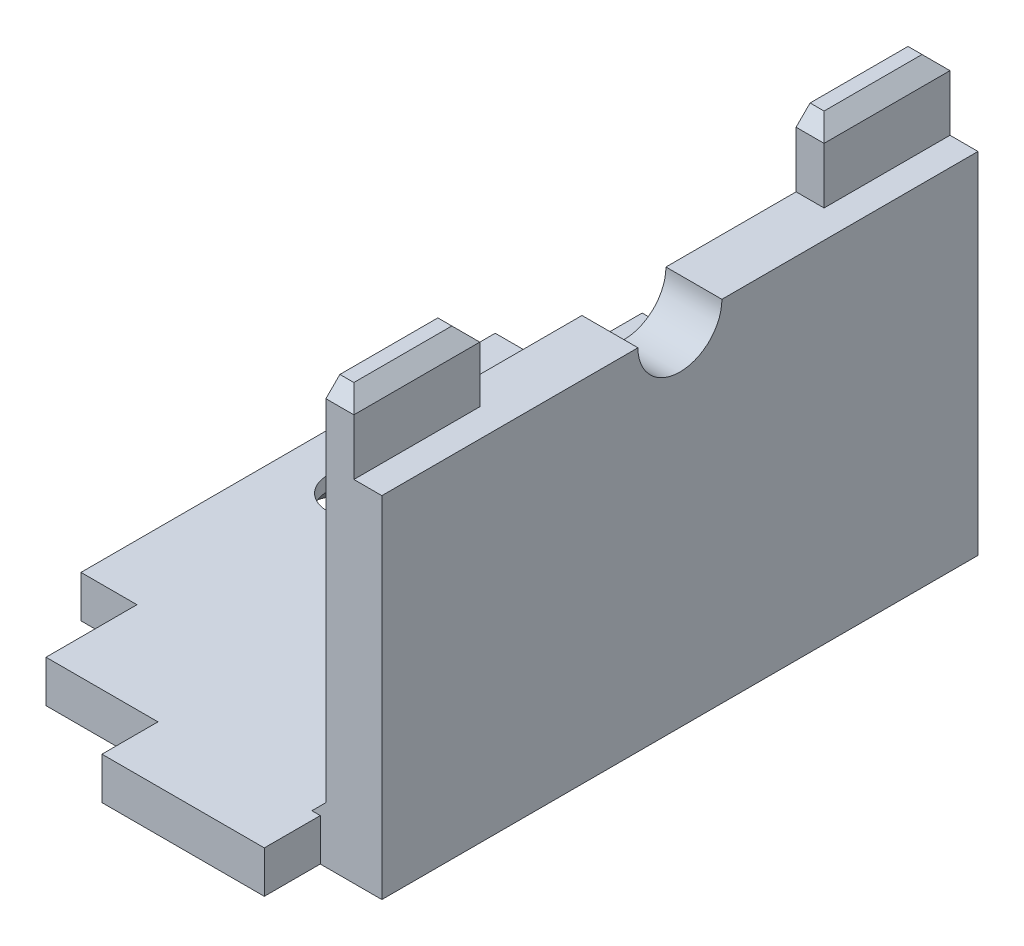
ISO-10303-21;
HEADER;
FILE_DESCRIPTION(('STEP AP214'),'2;1');
FILE_NAME('part.step','',(''),(''),'','','');
FILE_SCHEMA(('AUTOMOTIVE_DESIGN { 1 0 10303 214 1 1 1 1 }'));
ENDSEC;
DATA;
#1=APPLICATION_CONTEXT('core data for automotive mechanical design processes');
#2=APPLICATION_PROTOCOL_DEFINITION('international standard','automotive_design',2000,#1);
#3=PRODUCT_CONTEXT('',#1,'mechanical');
#4=PRODUCT('Part','Part','',(#3));
#5=PRODUCT_RELATED_PRODUCT_CATEGORY('part','',(#4));
#6=PRODUCT_DEFINITION_FORMATION('','',#4);
#7=PRODUCT_DEFINITION_CONTEXT('part definition',#1,'design');
#8=PRODUCT_DEFINITION('design','',#6,#7);
#9=PRODUCT_DEFINITION_SHAPE('','',#8);
#10=(LENGTH_UNIT() NAMED_UNIT(*) SI_UNIT(.MILLI.,.METRE.));
#11=(NAMED_UNIT(*) PLANE_ANGLE_UNIT() SI_UNIT($,.RADIAN.));
#12=(NAMED_UNIT(*) SI_UNIT($,.STERADIAN.) SOLID_ANGLE_UNIT());
#13=UNCERTAINTY_MEASURE_WITH_UNIT(LENGTH_MEASURE(1.E-05),#10,'distance_accuracy_value','');
#14=(GEOMETRIC_REPRESENTATION_CONTEXT(3) GLOBAL_UNCERTAINTY_ASSIGNED_CONTEXT((#13)) GLOBAL_UNIT_ASSIGNED_CONTEXT((#10,
#11,#12)) REPRESENTATION_CONTEXT('',''));
#15=CARTESIAN_POINT('',(0.,0.,0.));
#16=DIRECTION('',(0.,0.,1.));
#17=DIRECTION('',(1.,0.,0.));
#18=AXIS2_PLACEMENT_3D('',#15,#16,#17);
#19=CARTESIAN_POINT('',(0.,1.5,0.));
#20=DIRECTION('',(0.,0.,-1.));
#21=DIRECTION('',(-1.,0.,0.));
#22=AXIS2_PLACEMENT_3D('',#19,#20,#21);
#23=PLANE('',#22);
#24=DIRECTION('',(0.,-1.,0.));
#25=VECTOR('',#24,1.);
#26=CARTESIAN_POINT('',(4.,0.,0.));
#27=LINE('',#26,#25);
#28=CARTESIAN_POINT('',(4.,1.5,0.));
#29=VERTEX_POINT('',#28);
#30=CARTESIAN_POINT('',(4.,0.,0.));
#31=VERTEX_POINT('',#30);
#32=EDGE_CURVE('E232',#29,#31,#27,.T.);
#33=ORIENTED_EDGE('',*,*,#32,.F.);
#34=DIRECTION('',(1.,0.,0.));
#35=VECTOR('',#34,1.);
#36=CARTESIAN_POINT('',(0.,1.5,0.));
#37=LINE('',#36,#35);
#38=CARTESIAN_POINT('',(0.,1.5,0.));
#39=VERTEX_POINT('',#38);
#40=EDGE_CURVE('E361',#39,#29,#37,.T.);
#41=ORIENTED_EDGE('',*,*,#40,.F.);
#42=DIRECTION('',(0.,-1.,0.));
#43=VECTOR('',#42,1.);
#44=CARTESIAN_POINT('',(0.,1.5,0.));
#45=LINE('',#44,#43);
#46=CARTESIAN_POINT('',(0.,0.,0.));
#47=VERTEX_POINT('',#46);
#48=EDGE_CURVE('E365',#39,#47,#45,.T.);
#49=ORIENTED_EDGE('',*,*,#48,.T.);
#50=DIRECTION('',(1.,0.,0.));
#51=VECTOR('',#50,1.);
#52=CARTESIAN_POINT('',(0.,0.,0.));
#53=LINE('',#52,#51);
#54=EDGE_CURVE('E297',#47,#31,#53,.T.);
#55=ORIENTED_EDGE('',*,*,#54,.T.);
#56=EDGE_LOOP('',(#33,#41,#49,#55));
#57=FACE_BOUND('',#56,.T.);
#58=ADVANCED_FACE('F33',(#57),#23,.F.);
#59=DIRECTION('',(0.,1.,0.));
#60=VECTOR('',#59,1.);
#61=CARTESIAN_POINT('',(9.8,0.,0.));
#62=LINE('',#61,#60);
#63=CARTESIAN_POINT('',(9.8,0.,0.));
#64=VERTEX_POINT('',#63);
#65=CARTESIAN_POINT('',(9.8,1.5,0.));
#66=VERTEX_POINT('',#65);
#67=EDGE_CURVE('E37',#64,#66,#62,.T.);
#68=ORIENTED_EDGE('',*,*,#67,.F.);
#69=CARTESIAN_POINT('',(12.,0.,0.));
#70=VERTEX_POINT('',#69);
#71=EDGE_CURVE('E255',#64,#70,#53,.T.);
#72=ORIENTED_EDGE('',*,*,#71,.T.);
#73=DIRECTION('',(0.,-1.,0.));
#74=VECTOR('',#73,1.);
#75=CARTESIAN_POINT('',(12.,1.5,0.));
#76=LINE('',#75,#74);
#77=CARTESIAN_POINT('',(12.,12.5,0.));
#78=VERTEX_POINT('',#77);
#79=EDGE_CURVE('E390',#78,#70,#76,.T.);
#80=ORIENTED_EDGE('',*,*,#79,.F.);
#81=DIRECTION('',(1.,0.,0.));
#82=VECTOR('',#81,1.);
#83=CARTESIAN_POINT('',(12.,12.5,0.));
#84=LINE('',#83,#82);
#85=CARTESIAN_POINT('',(11.,12.5,0.));
#86=VERTEX_POINT('',#85);
#87=EDGE_CURVE('E357',#86,#78,#84,.T.);
#88=ORIENTED_EDGE('',*,*,#87,.F.);
#89=DIRECTION('',(0.,-1.,0.));
#90=VECTOR('',#89,1.);
#91=CARTESIAN_POINT('',(11.,15.,0.));
#92=LINE('',#91,#90);
#93=CARTESIAN_POINT('',(11.,14.5,0.));
#94=VERTEX_POINT('',#93);
#95=EDGE_CURVE('E465',#94,#86,#92,.T.);
#96=ORIENTED_EDGE('',*,*,#95,.F.);
#97=DIRECTION('',(-1.,0.,0.));
#98=VECTOR('',#97,1.);
#99=CARTESIAN_POINT('',(10.,14.5,0.));
#100=LINE('',#99,#98);
#101=CARTESIAN_POINT('',(10.,14.5,0.));
#102=VERTEX_POINT('',#101);
#103=EDGE_CURVE('E11',#94,#102,#100,.T.);
#104=ORIENTED_EDGE('',*,*,#103,.T.);
#105=DIRECTION('',(0.,-1.,0.));
#106=VECTOR('',#105,1.);
#107=CARTESIAN_POINT('',(10.,12.5,0.));
#108=LINE('',#107,#106);
#109=CARTESIAN_POINT('',(10.,2.,0.));
#110=VERTEX_POINT('',#109);
#111=EDGE_CURVE('E355',#102,#110,#108,.T.);
#112=ORIENTED_EDGE('',*,*,#111,.T.);
#113=DIRECTION('',(0.707106781186543,0.707106781186552,0.));
#114=VECTOR('',#113,1.);
#115=CARTESIAN_POINT('',(4.75000000000006,-3.25,0.));
#116=LINE('',#115,#114);
#117=CARTESIAN_POINT('',(9.50000000000001,1.5,0.));
#118=VERTEX_POINT('',#117);
#119=EDGE_CURVE('E258',#110,#118,#116,.F.);
#120=ORIENTED_EDGE('',*,*,#119,.T.);
#121=DIRECTION('',(-1.,0.,0.));
#122=VECTOR('',#121,1.);
#123=CARTESIAN_POINT('',(9.8,1.5,0.));
#124=LINE('',#123,#122);
#125=EDGE_CURVE('E247',#66,#118,#124,.T.);
#126=ORIENTED_EDGE('',*,*,#125,.F.);
#127=EDGE_LOOP('',(#68,#72,#80,#88,#96,#104,#112,#120,#126));
#128=FACE_BOUND('',#127,.T.);
#129=ADVANCED_FACE('F543',(#128),#23,.F.);
#130=CARTESIAN_POINT('',(0.,12.5,0.));
#131=DIRECTION('',(0.,-1.,0.));
#132=DIRECTION('',(0.,0.,-1.));
#133=AXIS2_PLACEMENT_3D('',#130,#131,#132);
#134=PLANE('',#133);
#135=DIRECTION('',(1.,0.,0.));
#136=VECTOR('',#135,1.);
#137=CARTESIAN_POINT('',(10.,12.5,-16.8));
#138=LINE('',#137,#136);
#139=CARTESIAN_POINT('',(10.,12.5,-16.8));
#140=VERTEX_POINT('',#139);
#141=CARTESIAN_POINT('',(11.,12.5,-16.8));
#142=VERTEX_POINT('',#141);
#143=EDGE_CURVE('E328',#140,#142,#138,.T.);
#144=ORIENTED_EDGE('',*,*,#143,.F.);
#145=DIRECTION('',(0.,0.,1.));
#146=VECTOR('',#145,1.);
#147=CARTESIAN_POINT('',(10.,12.5,-21.3));
#148=LINE('',#147,#146);
#149=CARTESIAN_POINT('',(10.,12.5,-12.15));
#150=VERTEX_POINT('',#149);
#151=EDGE_CURVE('E515',#140,#150,#148,.T.);
#152=ORIENTED_EDGE('',*,*,#151,.T.);
#153=DIRECTION('',(-1.,0.,0.));
#154=VECTOR('',#153,1.);
#155=CARTESIAN_POINT('',(16.2426406871193,12.5,-12.15));
#156=LINE('',#155,#154);
#157=CARTESIAN_POINT('',(12.,12.5,-12.15));
#158=VERTEX_POINT('',#157);
#159=EDGE_CURVE('E394',#150,#158,#156,.F.);
#160=ORIENTED_EDGE('',*,*,#159,.T.);
#161=DIRECTION('',(0.,0.,-1.));
#162=VECTOR('',#161,1.);
#163=CARTESIAN_POINT('',(12.,12.5,-21.3));
#164=LINE('',#163,#162);
#165=CARTESIAN_POINT('',(12.,12.5,-21.3));
#166=VERTEX_POINT('',#165);
#167=EDGE_CURVE('E505',#158,#166,#164,.T.);
#168=ORIENTED_EDGE('',*,*,#167,.T.);
#169=DIRECTION('',(-1.,0.,0.));
#170=VECTOR('',#169,1.);
#171=CARTESIAN_POINT('',(12.,12.5,-21.3));
#172=LINE('',#171,#170);
#173=CARTESIAN_POINT('',(11.,12.5,-21.3));
#174=VERTEX_POINT('',#173);
#175=EDGE_CURVE('E512',#166,#174,#172,.T.);
#176=ORIENTED_EDGE('',*,*,#175,.T.);
#177=DIRECTION('',(0.,0.,-1.));
#178=VECTOR('',#177,1.);
#179=CARTESIAN_POINT('',(11.,12.5,-16.8));
#180=LINE('',#179,#178);
#181=EDGE_CURVE('E439',#142,#174,#180,.T.);
#182=ORIENTED_EDGE('',*,*,#181,.F.);
#183=EDGE_LOOP('',(#144,#152,#160,#168,#176,#182));
#184=FACE_BOUND('',#183,.T.);
#185=ADVANCED_FACE('F566',(#184),#134,.F.);
#186=DIRECTION('',(0.,0.,-1.));
#187=VECTOR('',#186,1.);
#188=CARTESIAN_POINT('',(11.,12.5,-4.5));
#189=LINE('',#188,#187);
#190=CARTESIAN_POINT('',(11.,12.5,-4.5));
#191=VERTEX_POINT('',#190);
#192=EDGE_CURVE('E452',#86,#191,#189,.T.);
#193=ORIENTED_EDGE('',*,*,#192,.F.);
#194=ORIENTED_EDGE('',*,*,#87,.T.);
#195=CARTESIAN_POINT('',(12.,12.5,-9.15));
#196=VERTEX_POINT('',#195);
#197=EDGE_CURVE('E509',#78,#196,#164,.T.);
#198=ORIENTED_EDGE('',*,*,#197,.T.);
#199=DIRECTION('',(-1.,0.,0.));
#200=VECTOR('',#199,1.);
#201=CARTESIAN_POINT('',(16.2426406871193,12.5,-9.15));
#202=LINE('',#201,#200);
#203=CARTESIAN_POINT('',(10.,12.5,-9.15));
#204=VERTEX_POINT('',#203);
#205=EDGE_CURVE('E398',#196,#204,#202,.T.);
#206=ORIENTED_EDGE('',*,*,#205,.T.);
#207=CARTESIAN_POINT('',(10.,12.5,-4.5));
#208=VERTEX_POINT('',#207);
#209=EDGE_CURVE('E514',#204,#208,#148,.T.);
#210=ORIENTED_EDGE('',*,*,#209,.T.);
#211=DIRECTION('',(-1.,0.,0.));
#212=VECTOR('',#211,1.);
#213=CARTESIAN_POINT('',(10.,12.5,-4.5));
#214=LINE('',#213,#212);
#215=EDGE_CURVE('E457',#191,#208,#214,.T.);
#216=ORIENTED_EDGE('',*,*,#215,.F.);
#217=EDGE_LOOP('',(#193,#194,#198,#206,#210,#216));
#218=FACE_BOUND('',#217,.T.);
#219=ADVANCED_FACE('F523',(#218),#134,.F.);
#220=CARTESIAN_POINT('',(0.,1.5,0.));
#221=DIRECTION('',(1.,0.,0.));
#222=DIRECTION('',(0.,0.,-1.));
#223=AXIS2_PLACEMENT_3D('',#220,#221,#222);
#224=PLANE('',#223);
#225=DIRECTION('',(0.,1.,0.));
#226=VECTOR('',#225,1.);
#227=CARTESIAN_POINT('',(0.,-14.9345237620756,-3.25));
#228=LINE('',#227,#226);
#229=CARTESIAN_POINT('',(0.,0.,-3.25));
#230=VERTEX_POINT('',#229);
#231=CARTESIAN_POINT('',(0.,1.5,-3.25));
#232=VERTEX_POINT('',#231);
#233=EDGE_CURVE('E488',#230,#232,#228,.T.);
#234=ORIENTED_EDGE('',*,*,#233,.F.);
#235=DIRECTION('',(0.,0.,1.));
#236=VECTOR('',#235,1.);
#237=CARTESIAN_POINT('',(0.,0.,0.));
#238=LINE('',#237,#236);
#239=EDGE_CURVE('E300',#230,#47,#238,.T.);
#240=ORIENTED_EDGE('',*,*,#239,.T.);
#241=ORIENTED_EDGE('',*,*,#48,.F.);
#242=DIRECTION('',(0.,0.,1.));
#243=VECTOR('',#242,1.);
#244=CARTESIAN_POINT('',(0.,1.5,0.));
#245=LINE('',#244,#243);
#246=EDGE_CURVE('E374',#232,#39,#245,.T.);
#247=ORIENTED_EDGE('',*,*,#246,.F.);
#248=EDGE_LOOP('',(#234,#240,#241,#247));
#249=FACE_BOUND('',#248,.T.);
#250=ADVANCED_FACE('F598',(#249),#224,.F.);
#251=CARTESIAN_POINT('',(0.,1.5,0.));
#252=DIRECTION('',(0.,-1.,0.));
#253=DIRECTION('',(0.,0.,-1.));
#254=AXIS2_PLACEMENT_3D('',#251,#252,#253);
#255=PLANE('',#254);
#256=CARTESIAN_POINT('',(0.5,1.5,-10.65));
#257=DIRECTION('',(0.,1.,0.));
#258=DIRECTION('',(0.,0.,1.));
#259=AXIS2_PLACEMENT_3D('',#256,#257,#258);
#260=CIRCLE('',#259,1.1);
#261=CARTESIAN_POINT('',(0.5,1.5,-9.55000000000003));
#262=VERTEX_POINT('',#261);
#263=EDGE_CURVE('E467',#262,#262,#260,.T.);
#264=ORIENTED_EDGE('',*,*,#263,.F.);
#265=EDGE_LOOP('',(#264));
#266=FACE_BOUND('',#265,.T.);
#267=ORIENTED_EDGE('',*,*,#40,.T.);
#268=DIRECTION('',(0.,0.,-1.));
#269=VECTOR('',#268,1.);
#270=CARTESIAN_POINT('',(4.,1.5,2.));
#271=LINE('',#270,#269);
#272=CARTESIAN_POINT('',(4.,1.5,2.));
#273=VERTEX_POINT('',#272);
#274=EDGE_CURVE('E220',#273,#29,#271,.T.);
#275=ORIENTED_EDGE('',*,*,#274,.F.);
#276=DIRECTION('',(-1.,0.,0.));
#277=VECTOR('',#276,1.);
#278=CARTESIAN_POINT('',(9.8,1.5,2.));
#279=LINE('',#278,#277);
#280=CARTESIAN_POINT('',(9.8,1.5,2.));
#281=VERTEX_POINT('',#280);
#282=EDGE_CURVE('E213',#281,#273,#279,.T.);
#283=ORIENTED_EDGE('',*,*,#282,.F.);
#284=DIRECTION('',(0.,0.,-1.));
#285=VECTOR('',#284,1.);
#286=CARTESIAN_POINT('',(9.8,1.5,2.));
#287=LINE('',#286,#285);
#288=EDGE_CURVE('E218',#281,#66,#287,.T.);
#289=ORIENTED_EDGE('',*,*,#288,.T.);
#290=ORIENTED_EDGE('',*,*,#125,.T.);
#291=DIRECTION('',(0.,0.,-1.));
#292=VECTOR('',#291,1.);
#293=CARTESIAN_POINT('',(9.50000000000001,1.5,-21.3));
#294=LINE('',#293,#292);
#295=CARTESIAN_POINT('',(9.50000000000001,1.5,-21.3));
#296=VERTEX_POINT('',#295);
#297=EDGE_CURVE('E262',#118,#296,#294,.T.);
#298=ORIENTED_EDGE('',*,*,#297,.T.);
#299=DIRECTION('',(-1.,0.,0.));
#300=VECTOR('',#299,1.);
#301=CARTESIAN_POINT('',(0.,1.5,-21.3));
#302=LINE('',#301,#300);
#303=CARTESIAN_POINT('',(0.,1.5,-21.3));
#304=VERTEX_POINT('',#303);
#305=EDGE_CURVE('E363',#296,#304,#302,.T.);
#306=ORIENTED_EDGE('',*,*,#305,.T.);
#307=CARTESIAN_POINT('',(0.,1.5,-18.05));
#308=VERTEX_POINT('',#307);
#309=EDGE_CURVE('E364',#304,#308,#245,.T.);
#310=ORIENTED_EDGE('',*,*,#309,.T.);
#311=DIRECTION('',(-1.,0.,0.));
#312=VECTOR('',#311,1.);
#313=CARTESIAN_POINT('',(0.,1.5,-18.05));
#314=LINE('',#313,#312);
#315=CARTESIAN_POINT('',(-2.,1.5,-18.05));
#316=VERTEX_POINT('',#315);
#317=EDGE_CURVE('E474',#308,#316,#314,.T.);
#318=ORIENTED_EDGE('',*,*,#317,.T.);
#319=DIRECTION('',(0.,0.,1.));
#320=VECTOR('',#319,1.);
#321=CARTESIAN_POINT('',(-2.,1.5,-18.05));
#322=LINE('',#321,#320);
#323=CARTESIAN_POINT('',(-2.,1.5,-3.25));
#324=VERTEX_POINT('',#323);
#325=EDGE_CURVE('E475',#316,#324,#322,.T.);
#326=ORIENTED_EDGE('',*,*,#325,.T.);
#327=DIRECTION('',(1.,0.,0.));
#328=VECTOR('',#327,1.);
#329=CARTESIAN_POINT('',(0.,1.5,-3.25));
#330=LINE('',#329,#328);
#331=EDGE_CURVE('E478',#324,#232,#330,.T.);
#332=ORIENTED_EDGE('',*,*,#331,.T.);
#333=ORIENTED_EDGE('',*,*,#246,.T.);
#334=EDGE_LOOP('',(#267,#275,#283,#289,#290,#298,#306,#310,#318,#326,#332,#333));
#335=FACE_BOUND('',#334,.T.);
#336=ADVANCED_FACE('F216',(#266,#335),#255,.F.);
#337=CARTESIAN_POINT('',(0.,0.,-21.3));
#338=VERTEX_POINT('',#337);
#339=CARTESIAN_POINT('',(0.,0.,-18.05));
#340=VERTEX_POINT('',#339);
#341=EDGE_CURVE('E298',#338,#340,#238,.T.);
#342=ORIENTED_EDGE('',*,*,#341,.T.);
#343=DIRECTION('',(0.,1.,0.));
#344=VECTOR('',#343,1.);
#345=CARTESIAN_POINT('',(0.,-14.9345237620756,-18.05));
#346=LINE('',#345,#344);
#347=EDGE_CURVE('E491',#340,#308,#346,.T.);
#348=ORIENTED_EDGE('',*,*,#347,.T.);
#349=ORIENTED_EDGE('',*,*,#309,.F.);
#350=DIRECTION('',(0.,-1.,0.));
#351=VECTOR('',#350,1.);
#352=CARTESIAN_POINT('',(0.,1.5,-21.3));
#353=LINE('',#352,#351);
#354=EDGE_CURVE('E387',#304,#338,#353,.T.);
#355=ORIENTED_EDGE('',*,*,#354,.T.);
#356=EDGE_LOOP('',(#342,#348,#349,#355));
#357=FACE_BOUND('',#356,.T.);
#358=ADVANCED_FACE('F569',(#357),#224,.F.);
#359=CARTESIAN_POINT('',(12.,1.5,0.));
#360=DIRECTION('',(-1.,0.,0.));
#361=DIRECTION('',(0.,0.,1.));
#362=AXIS2_PLACEMENT_3D('',#359,#360,#361);
#363=PLANE('',#362);
#364=ORIENTED_EDGE('',*,*,#167,.F.);
#365=CARTESIAN_POINT('',(12.,12.5,-10.65));
#366=DIRECTION('',(-1.,0.,0.));
#367=DIRECTION('',(0.,0.,1.));
#368=AXIS2_PLACEMENT_3D('',#365,#366,#367);
#369=CIRCLE('',#368,1.5);
#370=EDGE_CURVE('E472',#196,#158,#369,.F.);
#371=ORIENTED_EDGE('',*,*,#370,.F.);
#372=ORIENTED_EDGE('',*,*,#197,.F.);
#373=ORIENTED_EDGE('',*,*,#79,.T.);
#374=DIRECTION('',(0.,0.,-1.));
#375=VECTOR('',#374,1.);
#376=CARTESIAN_POINT('',(12.,0.,0.));
#377=LINE('',#376,#375);
#378=CARTESIAN_POINT('',(12.,0.,-21.3));
#379=VERTEX_POINT('',#378);
#380=EDGE_CURVE('E293',#70,#379,#377,.T.);
#381=ORIENTED_EDGE('',*,*,#380,.T.);
#382=DIRECTION('',(0.,-1.,0.));
#383=VECTOR('',#382,1.);
#384=CARTESIAN_POINT('',(12.,1.5,-21.3));
#385=LINE('',#384,#383);
#386=EDGE_CURVE('E389',#166,#379,#385,.T.);
#387=ORIENTED_EDGE('',*,*,#386,.F.);
#388=EDGE_LOOP('',(#364,#371,#372,#373,#381,#387));
#389=FACE_BOUND('',#388,.T.);
#390=ADVANCED_FACE('F547',(#389),#363,.F.);
#391=CARTESIAN_POINT('',(0.,1.5,-21.3));
#392=DIRECTION('',(0.,0.,1.));
#393=DIRECTION('',(1.,0.,0.));
#394=AXIS2_PLACEMENT_3D('',#391,#392,#393);
#395=PLANE('',#394);
#396=DIRECTION('',(0.,-1.,0.));
#397=VECTOR('',#396,1.);
#398=CARTESIAN_POINT('',(10.,12.5,-21.3));
#399=LINE('',#398,#397);
#400=CARTESIAN_POINT('',(10.,14.5,-21.3));
#401=VERTEX_POINT('',#400);
#402=CARTESIAN_POINT('',(10.,2.,-21.3));
#403=VERTEX_POINT('',#402);
#404=EDGE_CURVE('E305',#401,#403,#399,.T.);
#405=ORIENTED_EDGE('',*,*,#404,.F.);
#406=DIRECTION('',(1.,0.,0.));
#407=VECTOR('',#406,1.);
#408=CARTESIAN_POINT('',(0.,14.5,-21.3));
#409=LINE('',#408,#407);
#410=CARTESIAN_POINT('',(11.,14.5,-21.3));
#411=VERTEX_POINT('',#410);
#412=EDGE_CURVE('E344',#401,#411,#409,.T.);
#413=ORIENTED_EDGE('',*,*,#412,.T.);
#414=DIRECTION('',(0.,-1.,0.));
#415=VECTOR('',#414,1.);
#416=CARTESIAN_POINT('',(11.,15.,-21.3));
#417=LINE('',#416,#415);
#418=EDGE_CURVE('E438',#411,#174,#417,.T.);
#419=ORIENTED_EDGE('',*,*,#418,.T.);
#420=ORIENTED_EDGE('',*,*,#175,.F.);
#421=ORIENTED_EDGE('',*,*,#386,.T.);
#422=DIRECTION('',(-1.,0.,0.));
#423=VECTOR('',#422,1.);
#424=CARTESIAN_POINT('',(0.,0.,-21.3));
#425=LINE('',#424,#423);
#426=EDGE_CURVE('E379',#379,#338,#425,.T.);
#427=ORIENTED_EDGE('',*,*,#426,.T.);
#428=ORIENTED_EDGE('',*,*,#354,.F.);
#429=ORIENTED_EDGE('',*,*,#305,.F.);
#430=DIRECTION('',(-0.707106781186543,-0.707106781186552,0.));
#431=VECTOR('',#430,1.);
#432=CARTESIAN_POINT('',(4.75000000000006,-3.25,-21.3));
#433=LINE('',#432,#431);
#434=EDGE_CURVE('E261',#296,#403,#433,.F.);
#435=ORIENTED_EDGE('',*,*,#434,.T.);
#436=EDGE_LOOP('',(#405,#413,#419,#420,#421,#427,#428,#429,#435));
#437=FACE_BOUND('',#436,.T.);
#438=ADVANCED_FACE('F561',(#437),#395,.F.);
#439=CARTESIAN_POINT('',(0.,0.,0.));
#440=DIRECTION('',(0.,-1.,0.));
#441=DIRECTION('',(0.,0.,-1.));
#442=AXIS2_PLACEMENT_3D('',#439,#440,#441);
#443=PLANE('',#442);
#444=CARTESIAN_POINT('',(0.5,0.,-10.65));
#445=DIRECTION('',(0.,-1.,0.));
#446=DIRECTION('',(0.,0.,-1.));
#447=AXIS2_PLACEMENT_3D('',#444,#445,#446);
#448=CIRCLE('',#447,2.1);
#449=CARTESIAN_POINT('',(0.5,0.,-12.75));
#450=VERTEX_POINT('',#449);
#451=EDGE_CURVE('E414',#450,#450,#448,.F.);
#452=ORIENTED_EDGE('',*,*,#451,.T.);
#453=EDGE_LOOP('',(#452));
#454=FACE_BOUND('',#453,.T.);
#455=ORIENTED_EDGE('',*,*,#341,.F.);
#456=ORIENTED_EDGE('',*,*,#426,.F.);
#457=ORIENTED_EDGE('',*,*,#380,.F.);
#458=ORIENTED_EDGE('',*,*,#71,.F.);
#459=DIRECTION('',(0.,0.,-1.));
#460=VECTOR('',#459,1.);
#461=CARTESIAN_POINT('',(9.8,0.,2.));
#462=LINE('',#461,#460);
#463=CARTESIAN_POINT('',(9.8,0.,2.));
#464=VERTEX_POINT('',#463);
#465=EDGE_CURVE('E274',#464,#64,#462,.T.);
#466=ORIENTED_EDGE('',*,*,#465,.F.);
#467=DIRECTION('',(1.,0.,0.));
#468=VECTOR('',#467,1.);
#469=CARTESIAN_POINT('',(9.8,0.,2.));
#470=LINE('',#469,#468);
#471=CARTESIAN_POINT('',(4.,0.,2.));
#472=VERTEX_POINT('',#471);
#473=EDGE_CURVE('E229',#472,#464,#470,.T.);
#474=ORIENTED_EDGE('',*,*,#473,.F.);
#475=DIRECTION('',(0.,0.,-1.));
#476=VECTOR('',#475,1.);
#477=CARTESIAN_POINT('',(4.,0.,2.));
#478=LINE('',#477,#476);
#479=EDGE_CURVE('E242',#472,#31,#478,.T.);
#480=ORIENTED_EDGE('',*,*,#479,.T.);
#481=ORIENTED_EDGE('',*,*,#54,.F.);
#482=ORIENTED_EDGE('',*,*,#239,.F.);
#483=DIRECTION('',(1.,0.,0.));
#484=VECTOR('',#483,1.);
#485=CARTESIAN_POINT('',(0.,0.,-3.25));
#486=LINE('',#485,#484);
#487=CARTESIAN_POINT('',(-2.,0.,-3.25));
#488=VERTEX_POINT('',#487);
#489=EDGE_CURVE('E492',#488,#230,#486,.T.);
#490=ORIENTED_EDGE('',*,*,#489,.F.);
#491=DIRECTION('',(0.,0.,1.));
#492=VECTOR('',#491,1.);
#493=CARTESIAN_POINT('',(-2.,0.,-18.05));
#494=LINE('',#493,#492);
#495=CARTESIAN_POINT('',(-2.,0.,-18.05));
#496=VERTEX_POINT('',#495);
#497=EDGE_CURVE('E479',#496,#488,#494,.T.);
#498=ORIENTED_EDGE('',*,*,#497,.F.);
#499=DIRECTION('',(-1.,0.,0.));
#500=VECTOR('',#499,1.);
#501=CARTESIAN_POINT('',(0.,0.,-18.05));
#502=LINE('',#501,#500);
#503=EDGE_CURVE('E497',#340,#496,#502,.T.);
#504=ORIENTED_EDGE('',*,*,#503,.F.);
#505=EDGE_LOOP('',(#455,#456,#457,#458,#466,#474,#480,#481,#482,#490,#498,#504));
#506=FACE_BOUND('',#505,.T.);
#507=ADVANCED_FACE('F289',(#454,#506),#443,.T.);
#508=CARTESIAN_POINT('',(10.,12.5,-21.3));
#509=DIRECTION('',(1.,0.,0.));
#510=DIRECTION('',(0.,0.,-1.));
#511=AXIS2_PLACEMENT_3D('',#508,#509,#510);
#512=PLANE('',#511);
#513=DIRECTION('',(0.,0.,1.));
#514=VECTOR('',#513,1.);
#515=CARTESIAN_POINT('',(10.,15.,-16.8));
#516=LINE('',#515,#514);
#517=CARTESIAN_POINT('',(10.,15.,-20.8));
#518=VERTEX_POINT('',#517);
#519=CARTESIAN_POINT('',(10.,15.,-17.3));
#520=VERTEX_POINT('',#519);
#521=EDGE_CURVE('E250',#518,#520,#516,.T.);
#522=ORIENTED_EDGE('',*,*,#521,.F.);
#523=DIRECTION('',(0.,0.707106781186552,0.707106781186543));
#524=VECTOR('',#523,1.);
#525=CARTESIAN_POINT('',(10.,15.,-20.8));
#526=LINE('',#525,#524);
#527=EDGE_CURVE('E346',#518,#401,#526,.F.);
#528=ORIENTED_EDGE('',*,*,#527,.T.);
#529=ORIENTED_EDGE('',*,*,#404,.T.);
#530=DIRECTION('',(0.,0.,1.));
#531=VECTOR('',#530,1.);
#532=CARTESIAN_POINT('',(10.,2.,0.));
#533=LINE('',#532,#531);
#534=EDGE_CURVE('E266',#403,#110,#533,.T.);
#535=ORIENTED_EDGE('',*,*,#534,.T.);
#536=ORIENTED_EDGE('',*,*,#111,.F.);
#537=DIRECTION('',(0.,0.707106781186548,-0.707106781186548));
#538=VECTOR('',#537,1.);
#539=CARTESIAN_POINT('',(10.,15.,-0.500000000000004));
#540=LINE('',#539,#538);
#541=CARTESIAN_POINT('',(10.,15.,-0.500000000000005));
#542=VERTEX_POINT('',#541);
#543=EDGE_CURVE('E352',#102,#542,#540,.T.);
#544=ORIENTED_EDGE('',*,*,#543,.T.);
#545=DIRECTION('',(0.,0.,1.));
#546=VECTOR('',#545,1.);
#547=CARTESIAN_POINT('',(10.,15.,-4.5));
#548=LINE('',#547,#546);
#549=CARTESIAN_POINT('',(10.,15.,-4.));
#550=VERTEX_POINT('',#549);
#551=EDGE_CURVE('E453',#550,#542,#548,.T.);
#552=ORIENTED_EDGE('',*,*,#551,.F.);
#553=DIRECTION('',(0.,-0.707106781186548,-0.707106781186548));
#554=VECTOR('',#553,1.);
#555=CARTESIAN_POINT('',(10.,15.,-4.));
#556=LINE('',#555,#554);
#557=CARTESIAN_POINT('',(10.,14.5,-4.5));
#558=VERTEX_POINT('',#557);
#559=EDGE_CURVE('E350',#550,#558,#556,.T.);
#560=ORIENTED_EDGE('',*,*,#559,.T.);
#561=DIRECTION('',(0.,-1.,0.));
#562=VECTOR('',#561,1.);
#563=CARTESIAN_POINT('',(10.,15.,-4.5));
#564=LINE('',#563,#562);
#565=EDGE_CURVE('E456',#558,#208,#564,.T.);
#566=ORIENTED_EDGE('',*,*,#565,.T.);
#567=ORIENTED_EDGE('',*,*,#209,.F.);
#568=CARTESIAN_POINT('',(10.,12.5,-10.65));
#569=DIRECTION('',(-1.,0.,0.));
#570=DIRECTION('',(0.,0.,1.));
#571=AXIS2_PLACEMENT_3D('',#568,#569,#570);
#572=CIRCLE('',#571,1.5);
#573=EDGE_CURVE('E470',#150,#204,#572,.T.);
#574=ORIENTED_EDGE('',*,*,#573,.F.);
#575=ORIENTED_EDGE('',*,*,#151,.F.);
#576=DIRECTION('',(0.,-1.,0.));
#577=VECTOR('',#576,1.);
#578=CARTESIAN_POINT('',(10.,15.,-16.8));
#579=LINE('',#578,#577);
#580=CARTESIAN_POINT('',(10.,14.5,-16.8));
#581=VERTEX_POINT('',#580);
#582=EDGE_CURVE('E450',#581,#140,#579,.T.);
#583=ORIENTED_EDGE('',*,*,#582,.F.);
#584=DIRECTION('',(0.,-0.707106781186552,0.707106781186543));
#585=VECTOR('',#584,1.);
#586=CARTESIAN_POINT('',(10.,15.,-17.3));
#587=LINE('',#586,#585);
#588=EDGE_CURVE('E348',#581,#520,#587,.F.);
#589=ORIENTED_EDGE('',*,*,#588,.T.);
#590=EDGE_LOOP('',(#522,#528,#529,#535,#536,#544,#552,#560,#566,#567,#574,#575,#583,#589));
#591=FACE_BOUND('',#590,.T.);
#592=ADVANCED_FACE('F434',(#591),#512,.F.);
#593=CARTESIAN_POINT('',(0.,-14.9345237620756,-18.05));
#594=DIRECTION('',(0.,0.,-1.));
#595=DIRECTION('',(-1.,0.,0.));
#596=AXIS2_PLACEMENT_3D('',#593,#594,#595);
#597=PLANE('',#596);
#598=ORIENTED_EDGE('',*,*,#347,.F.);
#599=ORIENTED_EDGE('',*,*,#503,.T.);
#600=DIRECTION('',(0.,1.,0.));
#601=VECTOR('',#600,1.);
#602=CARTESIAN_POINT('',(-2.,-14.9345237620756,-18.05));
#603=LINE('',#602,#601);
#604=EDGE_CURVE('E483',#496,#316,#603,.T.);
#605=ORIENTED_EDGE('',*,*,#604,.T.);
#606=ORIENTED_EDGE('',*,*,#317,.F.);
#607=EDGE_LOOP('',(#598,#599,#605,#606));
#608=FACE_BOUND('',#607,.T.);
#609=ADVANCED_FACE('F568',(#608),#597,.T.);
#610=CARTESIAN_POINT('',(-2.,-14.9345237620756,-18.05));
#611=DIRECTION('',(-1.,0.,0.));
#612=DIRECTION('',(0.,0.,1.));
#613=AXIS2_PLACEMENT_3D('',#610,#611,#612);
#614=PLANE('',#613);
#615=ORIENTED_EDGE('',*,*,#604,.F.);
#616=ORIENTED_EDGE('',*,*,#497,.T.);
#617=DIRECTION('',(0.,1.,0.));
#618=VECTOR('',#617,1.);
#619=CARTESIAN_POINT('',(-2.,-14.9345237620756,-3.25));
#620=LINE('',#619,#618);
#621=EDGE_CURVE('E482',#488,#324,#620,.T.);
#622=ORIENTED_EDGE('',*,*,#621,.T.);
#623=ORIENTED_EDGE('',*,*,#325,.F.);
#624=EDGE_LOOP('',(#615,#616,#622,#623));
#625=FACE_BOUND('',#624,.T.);
#626=ADVANCED_FACE('F617',(#625),#614,.T.);
#627=CARTESIAN_POINT('',(0.,-14.9345237620756,-3.25));
#628=DIRECTION('',(0.,0.,1.));
#629=DIRECTION('',(1.,0.,0.));
#630=AXIS2_PLACEMENT_3D('',#627,#628,#629);
#631=PLANE('',#630);
#632=ORIENTED_EDGE('',*,*,#621,.F.);
#633=ORIENTED_EDGE('',*,*,#489,.T.);
#634=ORIENTED_EDGE('',*,*,#233,.T.);
#635=ORIENTED_EDGE('',*,*,#331,.F.);
#636=EDGE_LOOP('',(#632,#633,#634,#635));
#637=FACE_BOUND('',#636,.T.);
#638=ADVANCED_FACE('F586',(#637),#631,.T.);
#639=CARTESIAN_POINT('',(16.2426406871193,12.5,-10.65));
#640=DIRECTION('',(-1.,0.,0.));
#641=DIRECTION('',(0.,0.,1.));
#642=AXIS2_PLACEMENT_3D('',#639,#640,#641);
#643=CYLINDRICAL_SURFACE('',#642,1.5);
#644=ORIENTED_EDGE('',*,*,#370,.T.);
#645=ORIENTED_EDGE('',*,*,#159,.F.);
#646=ORIENTED_EDGE('',*,*,#573,.T.);
#647=ORIENTED_EDGE('',*,*,#205,.F.);
#648=EDGE_LOOP('',(#644,#645,#646,#647));
#649=FACE_BOUND('',#648,.T.);
#650=ADVANCED_FACE('F550',(#649),#643,.F.);
#651=CARTESIAN_POINT('',(10.,2.,-21.3));
#652=DIRECTION('',(-0.707106781186552,0.707106781186543,0.));
#653=DIRECTION('',(0.,0.,-1.));
#654=AXIS2_PLACEMENT_3D('',#651,#652,#653);
#655=PLANE('',#654);
#656=ORIENTED_EDGE('',*,*,#434,.F.);
#657=ORIENTED_EDGE('',*,*,#297,.F.);
#658=ORIENTED_EDGE('',*,*,#119,.F.);
#659=ORIENTED_EDGE('',*,*,#534,.F.);
#660=EDGE_LOOP('',(#656,#657,#658,#659));
#661=FACE_BOUND('',#660,.T.);
#662=ADVANCED_FACE('F575',(#661),#655,.T.);
#663=CARTESIAN_POINT('',(0.5,-0.00105000000000005,-10.65));
#664=DIRECTION('',(0.,1.,0.));
#665=DIRECTION('',(0.,0.,1.));
#666=AXIS2_PLACEMENT_3D('',#663,#664,#665);
#667=CYLINDRICAL_SURFACE('',#666,1.1);
#668=CARTESIAN_POINT('',(0.5,1.,-10.65));
#669=DIRECTION('',(0.,-1.,0.));
#670=DIRECTION('',(0.,0.,-1.));
#671=AXIS2_PLACEMENT_3D('',#668,#669,#670);
#672=CIRCLE('',#671,1.1);
#673=CARTESIAN_POINT('',(0.5,1.,-11.75));
#674=VERTEX_POINT('',#673);
#675=EDGE_CURVE('E417',#674,#674,#672,.T.);
#676=ORIENTED_EDGE('',*,*,#675,.T.);
#677=EDGE_LOOP('',(#676));
#678=FACE_BOUND('',#677,.T.);
#679=ORIENTED_EDGE('',*,*,#263,.T.);
#680=EDGE_LOOP('',(#679));
#681=FACE_BOUND('',#680,.T.);
#682=ADVANCED_FACE('F577',(#678,#681),#667,.F.);
#683=CARTESIAN_POINT('',(0.5,0.,-10.65));
#684=DIRECTION('',(0.,-1.,0.));
#685=DIRECTION('',(0.,0.,-1.));
#686=AXIS2_PLACEMENT_3D('',#683,#684,#685);
#687=CONICAL_SURFACE('',#686,2.1,0.785398163397447);
#688=ORIENTED_EDGE('',*,*,#675,.F.);
#689=EDGE_LOOP('',(#688));
#690=FACE_BOUND('',#689,.T.);
#691=ORIENTED_EDGE('',*,*,#451,.F.);
#692=EDGE_LOOP('',(#691));
#693=FACE_BOUND('',#692,.T.);
#694=ADVANCED_FACE('F583',(#690,#693),#687,.F.);
#695=CARTESIAN_POINT('',(11.,15.,-4.5));
#696=DIRECTION('',(-1.,0.,0.));
#697=DIRECTION('',(0.,0.,1.));
#698=AXIS2_PLACEMENT_3D('',#695,#696,#697);
#699=PLANE('',#698);
#700=DIRECTION('',(0.,-1.,0.));
#701=VECTOR('',#700,1.);
#702=CARTESIAN_POINT('',(11.,15.,-4.5));
#703=LINE('',#702,#701);
#704=CARTESIAN_POINT('',(11.,14.5,-4.5));
#705=VERTEX_POINT('',#704);
#706=EDGE_CURVE('E463',#705,#191,#703,.T.);
#707=ORIENTED_EDGE('',*,*,#706,.F.);
#708=DIRECTION('',(0.,0.,1.));
#709=VECTOR('',#708,1.);
#710=CARTESIAN_POINT('',(11.,14.5,0.));
#711=LINE('',#710,#709);
#712=EDGE_CURVE('E43',#705,#94,#711,.T.);
#713=ORIENTED_EDGE('',*,*,#712,.T.);
#714=ORIENTED_EDGE('',*,*,#95,.T.);
#715=ORIENTED_EDGE('',*,*,#192,.T.);
#716=EDGE_LOOP('',(#707,#713,#714,#715));
#717=FACE_BOUND('',#716,.T.);
#718=ADVANCED_FACE('F526',(#717),#699,.F.);
#719=CARTESIAN_POINT('',(10.,15.,-4.5));
#720=DIRECTION('',(0.,0.,1.));
#721=DIRECTION('',(1.,0.,0.));
#722=AXIS2_PLACEMENT_3D('',#719,#720,#721);
#723=PLANE('',#722);
#724=ORIENTED_EDGE('',*,*,#565,.F.);
#725=DIRECTION('',(1.,0.,0.));
#726=VECTOR('',#725,1.);
#727=CARTESIAN_POINT('',(11.,14.5,-4.5));
#728=LINE('',#727,#726);
#729=EDGE_CURVE('E58',#558,#705,#728,.T.);
#730=ORIENTED_EDGE('',*,*,#729,.T.);
#731=ORIENTED_EDGE('',*,*,#706,.T.);
#732=ORIENTED_EDGE('',*,*,#215,.T.);
#733=EDGE_LOOP('',(#724,#730,#731,#732));
#734=FACE_BOUND('',#733,.T.);
#735=ADVANCED_FACE('F525',(#734),#723,.F.);
#736=CARTESIAN_POINT('',(0.,15.,0.));
#737=DIRECTION('',(0.,1.,0.));
#738=DIRECTION('',(0.,0.,1.));
#739=AXIS2_PLACEMENT_3D('',#736,#737,#738);
#740=PLANE('',#739);
#741=DIRECTION('',(0.,0.,-1.));
#742=VECTOR('',#741,1.);
#743=CARTESIAN_POINT('',(10.5,15.,-4.5));
#744=LINE('',#743,#742);
#745=CARTESIAN_POINT('',(10.5,15.,-0.500000000000004));
#746=VERTEX_POINT('',#745);
#747=CARTESIAN_POINT('',(10.5,15.,-4.));
#748=VERTEX_POINT('',#747);
#749=EDGE_CURVE('E336',#746,#748,#744,.T.);
#750=ORIENTED_EDGE('',*,*,#749,.T.);
#751=DIRECTION('',(-1.,0.,0.));
#752=VECTOR('',#751,1.);
#753=CARTESIAN_POINT('',(10.,15.,-4.));
#754=LINE('',#753,#752);
#755=EDGE_CURVE('E333',#748,#550,#754,.T.);
#756=ORIENTED_EDGE('',*,*,#755,.T.);
#757=ORIENTED_EDGE('',*,*,#551,.T.);
#758=DIRECTION('',(1.,0.,0.));
#759=VECTOR('',#758,1.);
#760=CARTESIAN_POINT('',(11.,15.,-0.500000000000004));
#761=LINE('',#760,#759);
#762=EDGE_CURVE('E338',#542,#746,#761,.T.);
#763=ORIENTED_EDGE('',*,*,#762,.T.);
#764=EDGE_LOOP('',(#750,#756,#757,#763));
#765=FACE_BOUND('',#764,.T.);
#766=ADVANCED_FACE('F537',(#765),#740,.T.);
#767=CARTESIAN_POINT('',(10.,15.,-16.8));
#768=DIRECTION('',(0.,0.,-1.));
#769=DIRECTION('',(-1.,0.,0.));
#770=AXIS2_PLACEMENT_3D('',#767,#768,#769);
#771=PLANE('',#770);
#772=DIRECTION('',(0.,-1.,0.));
#773=VECTOR('',#772,1.);
#774=CARTESIAN_POINT('',(11.,15.,-16.8));
#775=LINE('',#774,#773);
#776=CARTESIAN_POINT('',(11.,14.5,-16.8));
#777=VERTEX_POINT('',#776);
#778=EDGE_CURVE('E440',#777,#142,#775,.T.);
#779=ORIENTED_EDGE('',*,*,#778,.F.);
#780=DIRECTION('',(-1.,0.,0.));
#781=VECTOR('',#780,1.);
#782=CARTESIAN_POINT('',(10.,14.5,-16.8));
#783=LINE('',#782,#781);
#784=EDGE_CURVE('E340',#777,#581,#783,.T.);
#785=ORIENTED_EDGE('',*,*,#784,.T.);
#786=ORIENTED_EDGE('',*,*,#582,.T.);
#787=ORIENTED_EDGE('',*,*,#143,.T.);
#788=EDGE_LOOP('',(#779,#785,#786,#787));
#789=FACE_BOUND('',#788,.T.);
#790=ADVANCED_FACE('F565',(#789),#771,.F.);
#791=CARTESIAN_POINT('',(11.,15.,-16.8));
#792=DIRECTION('',(-1.,0.,0.));
#793=DIRECTION('',(0.,0.,1.));
#794=AXIS2_PLACEMENT_3D('',#791,#792,#793);
#795=PLANE('',#794);
#796=ORIENTED_EDGE('',*,*,#418,.F.);
#797=DIRECTION('',(0.,0.,1.));
#798=VECTOR('',#797,1.);
#799=CARTESIAN_POINT('',(11.,14.5,-16.8));
#800=LINE('',#799,#798);
#801=EDGE_CURVE('E342',#411,#777,#800,.T.);
#802=ORIENTED_EDGE('',*,*,#801,.T.);
#803=ORIENTED_EDGE('',*,*,#778,.T.);
#804=ORIENTED_EDGE('',*,*,#181,.T.);
#805=EDGE_LOOP('',(#796,#802,#803,#804));
#806=FACE_BOUND('',#805,.T.);
#807=ADVANCED_FACE('F563',(#806),#795,.F.);
#808=CARTESIAN_POINT('',(0.,15.,0.));
#809=DIRECTION('',(0.,-1.,0.));
#810=DIRECTION('',(0.,0.,-1.));
#811=AXIS2_PLACEMENT_3D('',#808,#809,#810);
#812=PLANE('',#811);
#813=DIRECTION('',(0.,0.,-1.));
#814=VECTOR('',#813,1.);
#815=CARTESIAN_POINT('',(10.5,15.,0.));
#816=LINE('',#815,#814);
#817=CARTESIAN_POINT('',(10.5,15.,-17.3));
#818=VERTEX_POINT('',#817);
#819=CARTESIAN_POINT('',(10.5,15.,-20.8));
#820=VERTEX_POINT('',#819);
#821=EDGE_CURVE('E422',#818,#820,#816,.T.);
#822=ORIENTED_EDGE('',*,*,#821,.T.);
#823=DIRECTION('',(-1.,0.,0.));
#824=VECTOR('',#823,1.);
#825=CARTESIAN_POINT('',(0.,15.,-20.8));
#826=LINE('',#825,#824);
#827=EDGE_CURVE('E354',#820,#518,#826,.T.);
#828=ORIENTED_EDGE('',*,*,#827,.T.);
#829=ORIENTED_EDGE('',*,*,#521,.T.);
#830=DIRECTION('',(1.,0.,0.));
#831=VECTOR('',#830,1.);
#832=CARTESIAN_POINT('',(0.,15.,-17.3));
#833=LINE('',#832,#831);
#834=EDGE_CURVE('E420',#520,#818,#833,.T.);
#835=ORIENTED_EDGE('',*,*,#834,.T.);
#836=EDGE_LOOP('',(#822,#828,#829,#835));
#837=FACE_BOUND('',#836,.T.);
#838=ADVANCED_FACE('F428',(#837),#812,.F.);
#839=CARTESIAN_POINT('',(0.,15.,-17.3));
#840=DIRECTION('',(0.,-0.707106781186542,-0.707106781186552));
#841=DIRECTION('',(1.,0.,0.));
#842=AXIS2_PLACEMENT_3D('',#839,#840,#841);
#843=PLANE('',#842);
#844=ORIENTED_EDGE('',*,*,#588,.F.);
#845=ORIENTED_EDGE('',*,*,#784,.F.);
#846=DIRECTION('',(-0.577350269189623,0.577350269189631,-0.577350269189623));
#847=VECTOR('',#846,1.);
#848=CARTESIAN_POINT('',(7.00000000000003,18.5,-20.8));
#849=LINE('',#848,#847);
#850=EDGE_CURVE('E325',#818,#777,#849,.F.);
#851=ORIENTED_EDGE('',*,*,#850,.F.);
#852=ORIENTED_EDGE('',*,*,#834,.F.);
#853=EDGE_LOOP('',(#844,#845,#851,#852));
#854=FACE_BOUND('',#853,.T.);
#855=ADVANCED_FACE('F554',(#854),#843,.F.);
#856=CARTESIAN_POINT('',(10.5,15.,0.));
#857=DIRECTION('',(-0.707106781186552,-0.707106781186542,0.));
#858=DIRECTION('',(0.,0.,-1.));
#859=AXIS2_PLACEMENT_3D('',#856,#857,#858);
#860=PLANE('',#859);
#861=ORIENTED_EDGE('',*,*,#850,.T.);
#862=ORIENTED_EDGE('',*,*,#801,.F.);
#863=DIRECTION('',(-0.577350269189623,0.577350269189631,0.577350269189623));
#864=VECTOR('',#863,1.);
#865=CARTESIAN_POINT('',(3.56666666666673,21.9333333333334,-13.8666666666667));
#866=LINE('',#865,#864);
#867=EDGE_CURVE('E323',#820,#411,#866,.F.);
#868=ORIENTED_EDGE('',*,*,#867,.F.);
#869=ORIENTED_EDGE('',*,*,#821,.F.);
#870=EDGE_LOOP('',(#861,#862,#868,#869));
#871=FACE_BOUND('',#870,.T.);
#872=ADVANCED_FACE('F558',(#871),#860,.F.);
#873=CARTESIAN_POINT('',(0.,15.,-20.8));
#874=DIRECTION('',(0.,-0.707106781186542,0.707106781186552));
#875=DIRECTION('',(-1.,0.,0.));
#876=AXIS2_PLACEMENT_3D('',#873,#874,#875);
#877=PLANE('',#876);
#878=ORIENTED_EDGE('',*,*,#867,.T.);
#879=ORIENTED_EDGE('',*,*,#412,.F.);
#880=ORIENTED_EDGE('',*,*,#527,.F.);
#881=ORIENTED_EDGE('',*,*,#827,.F.);
#882=EDGE_LOOP('',(#878,#879,#880,#881));
#883=FACE_BOUND('',#882,.T.);
#884=ADVANCED_FACE('F560',(#883),#877,.F.);
#885=CARTESIAN_POINT('',(0.,15.,-0.500000000000004));
#886=DIRECTION('',(0.,0.707106781186547,0.707106781186547));
#887=DIRECTION('',(-1.,0.,0.));
#888=AXIS2_PLACEMENT_3D('',#885,#886,#887);
#889=PLANE('',#888);
#890=ORIENTED_EDGE('',*,*,#543,.F.);
#891=ORIENTED_EDGE('',*,*,#103,.F.);
#892=DIRECTION('',(-0.577350269189626,0.577350269189626,-0.577350269189626));
#893=VECTOR('',#892,1.);
#894=CARTESIAN_POINT('',(7.,18.5,-4.));
#895=LINE('',#894,#893);
#896=EDGE_CURVE('E240',#746,#94,#895,.F.);
#897=ORIENTED_EDGE('',*,*,#896,.F.);
#898=ORIENTED_EDGE('',*,*,#762,.F.);
#899=EDGE_LOOP('',(#890,#891,#897,#898));
#900=FACE_BOUND('',#899,.T.);
#901=ADVANCED_FACE('F35',(#900),#889,.T.);
#902=CARTESIAN_POINT('',(10.5,15.,0.));
#903=DIRECTION('',(0.707106781186547,0.707106781186547,0.));
#904=DIRECTION('',(0.,0.,1.));
#905=AXIS2_PLACEMENT_3D('',#902,#903,#904);
#906=PLANE('',#905);
#907=ORIENTED_EDGE('',*,*,#896,.T.);
#908=ORIENTED_EDGE('',*,*,#712,.F.);
#909=DIRECTION('',(-0.577350269189626,0.577350269189626,0.577350269189626));
#910=VECTOR('',#909,1.);
#911=CARTESIAN_POINT('',(9.16666666666666,16.3333333333333,-2.66666666666666));
#912=LINE('',#911,#910);
#913=EDGE_CURVE('E237',#748,#705,#912,.F.);
#914=ORIENTED_EDGE('',*,*,#913,.F.);
#915=ORIENTED_EDGE('',*,*,#749,.F.);
#916=EDGE_LOOP('',(#907,#908,#914,#915));
#917=FACE_BOUND('',#916,.T.);
#918=ADVANCED_FACE('F529',(#917),#906,.T.);
#919=CARTESIAN_POINT('',(0.,15.,-4.));
#920=DIRECTION('',(0.,0.707106781186547,-0.707106781186547));
#921=DIRECTION('',(1.,0.,0.));
#922=AXIS2_PLACEMENT_3D('',#919,#920,#921);
#923=PLANE('',#922);
#924=ORIENTED_EDGE('',*,*,#913,.T.);
#925=ORIENTED_EDGE('',*,*,#729,.F.);
#926=ORIENTED_EDGE('',*,*,#559,.F.);
#927=ORIENTED_EDGE('',*,*,#755,.F.);
#928=EDGE_LOOP('',(#924,#925,#926,#927));
#929=FACE_BOUND('',#928,.T.);
#930=ADVANCED_FACE('F534',(#929),#923,.T.);
#931=CARTESIAN_POINT('',(9.8,0.,2.));
#932=DIRECTION('',(-1.,0.,0.));
#933=DIRECTION('',(0.,0.,1.));
#934=AXIS2_PLACEMENT_3D('',#931,#932,#933);
#935=PLANE('',#934);
#936=ORIENTED_EDGE('',*,*,#67,.T.);
#937=ORIENTED_EDGE('',*,*,#288,.F.);
#938=DIRECTION('',(0.,1.,0.));
#939=VECTOR('',#938,1.);
#940=CARTESIAN_POINT('',(9.8,0.,2.));
#941=LINE('',#940,#939);
#942=EDGE_CURVE('E224',#464,#281,#941,.T.);
#943=ORIENTED_EDGE('',*,*,#942,.F.);
#944=ORIENTED_EDGE('',*,*,#465,.T.);
#945=EDGE_LOOP('',(#936,#937,#943,#944));
#946=FACE_BOUND('',#945,.T.);
#947=ADVANCED_FACE('F234',(#946),#935,.F.);
#948=CARTESIAN_POINT('',(4.,0.,2.));
#949=DIRECTION('',(1.,0.,0.));
#950=DIRECTION('',(0.,0.,-1.));
#951=AXIS2_PLACEMENT_3D('',#948,#949,#950);
#952=PLANE('',#951);
#953=ORIENTED_EDGE('',*,*,#32,.T.);
#954=ORIENTED_EDGE('',*,*,#479,.F.);
#955=DIRECTION('',(0.,-1.,0.));
#956=VECTOR('',#955,1.);
#957=CARTESIAN_POINT('',(4.,0.,2.));
#958=LINE('',#957,#956);
#959=EDGE_CURVE('E223',#273,#472,#958,.T.);
#960=ORIENTED_EDGE('',*,*,#959,.F.);
#961=ORIENTED_EDGE('',*,*,#274,.T.);
#962=EDGE_LOOP('',(#953,#954,#960,#961));
#963=FACE_BOUND('',#962,.T.);
#964=ADVANCED_FACE('F283',(#963),#952,.F.);
#965=CARTESIAN_POINT('',(0.,0.,2.));
#966=DIRECTION('',(0.,0.,1.));
#967=DIRECTION('',(1.,0.,0.));
#968=AXIS2_PLACEMENT_3D('',#965,#966,#967);
#969=PLANE('',#968);
#970=ORIENTED_EDGE('',*,*,#942,.T.);
#971=ORIENTED_EDGE('',*,*,#282,.T.);
#972=ORIENTED_EDGE('',*,*,#959,.T.);
#973=ORIENTED_EDGE('',*,*,#473,.T.);
#974=EDGE_LOOP('',(#970,#971,#972,#973));
#975=FACE_BOUND('',#974,.T.);
#976=ADVANCED_FACE('F227',(#975),#969,.T.);
#977=CLOSED_SHELL('',(#58,#129,#185,#219,#250,#336,#358,#390,#438,#507,#592,#609,#626,#638,#650,
#662,#682,#694,#718,#735,#766,#790,#807,#838,#855,#872,#884,#901,#918,#930,#947,#964,#976));
#978=MANIFOLD_SOLID_BREP('B2',#977);
#979=ADVANCED_BREP_SHAPE_REPRESENTATION('',(#18,#978),#14);
#980=SHAPE_DEFINITION_REPRESENTATION(#9,#979);
ENDSEC;
END-ISO-10303-21;
